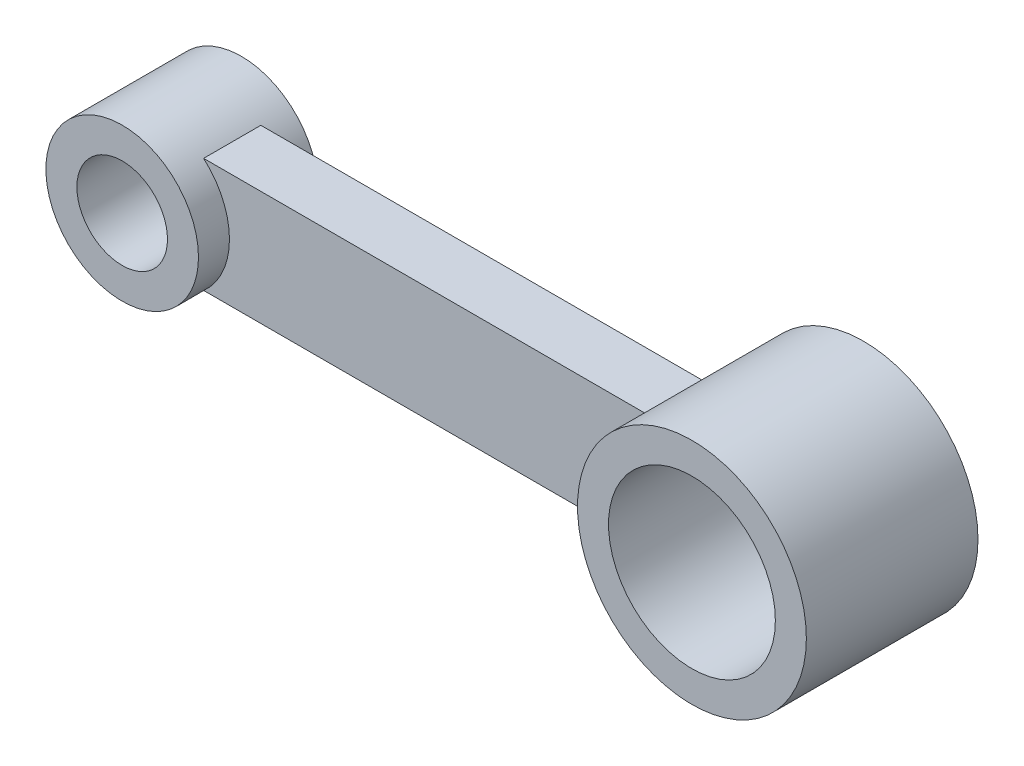
ISO-10303-21;
HEADER;
FILE_DESCRIPTION(('STEP AP214'),'2;1');
FILE_NAME('part.step','',(''),(''),'','','');
FILE_SCHEMA(('AUTOMOTIVE_DESIGN { 1 0 10303 214 1 1 1 1 }'));
ENDSEC;
DATA;
#1=APPLICATION_CONTEXT('core data for automotive mechanical design processes');
#2=APPLICATION_PROTOCOL_DEFINITION('international standard','automotive_design',2000,#1);
#3=PRODUCT_CONTEXT('',#1,'mechanical');
#4=PRODUCT('Part','Part','',(#3));
#5=PRODUCT_RELATED_PRODUCT_CATEGORY('part','',(#4));
#6=PRODUCT_DEFINITION_FORMATION('','',#4);
#7=PRODUCT_DEFINITION_CONTEXT('part definition',#1,'design');
#8=PRODUCT_DEFINITION('design','',#6,#7);
#9=PRODUCT_DEFINITION_SHAPE('','',#8);
#10=(LENGTH_UNIT() NAMED_UNIT(*) SI_UNIT(.MILLI.,.METRE.));
#11=(NAMED_UNIT(*) PLANE_ANGLE_UNIT() SI_UNIT($,.RADIAN.));
#12=(NAMED_UNIT(*) SI_UNIT($,.STERADIAN.) SOLID_ANGLE_UNIT());
#13=UNCERTAINTY_MEASURE_WITH_UNIT(LENGTH_MEASURE(1.E-05),#10,'distance_accuracy_value','');
#14=(GEOMETRIC_REPRESENTATION_CONTEXT(3) GLOBAL_UNCERTAINTY_ASSIGNED_CONTEXT((#13)) GLOBAL_UNIT_ASSIGNED_CONTEXT((#10,
#11,#12)) REPRESENTATION_CONTEXT('',''));
#15=CARTESIAN_POINT('',(0.,0.,0.));
#16=DIRECTION('',(0.,0.,1.));
#17=DIRECTION('',(1.,0.,0.));
#18=AXIS2_PLACEMENT_3D('',#15,#16,#17);
#19=CARTESIAN_POINT('',(0.,0.,36.));
#20=DIRECTION('',(0.,0.,-1.));
#21=DIRECTION('',(-1.,0.,0.));
#22=AXIS2_PLACEMENT_3D('',#19,#20,#21);
#23=CYLINDRICAL_SURFACE('',#22,9.5);
#24=CARTESIAN_POINT('',(0.,0.,30.5));
#25=DIRECTION('',(0.,0.,1.));
#26=DIRECTION('',(1.,0.,0.));
#27=AXIS2_PLACEMENT_3D('',#24,#25,#26);
#28=CIRCLE('',#27,9.5);
#29=CARTESIAN_POINT('',(9.5,0.,30.5));
#30=VERTEX_POINT('',#29);
#31=EDGE_CURVE('E121',#30,#30,#28,.T.);
#32=ORIENTED_EDGE('',*,*,#31,.T.);
#33=EDGE_LOOP('',(#32));
#34=FACE_BOUND('',#33,.T.);
#35=CARTESIAN_POINT('',(0.,0.,5.5));
#36=DIRECTION('',(0.,0.,-1.));
#37=DIRECTION('',(-1.,0.,0.));
#38=AXIS2_PLACEMENT_3D('',#35,#36,#37);
#39=CIRCLE('',#38,9.5);
#40=CARTESIAN_POINT('',(-9.5,0.,5.5));
#41=VERTEX_POINT('',#40);
#42=EDGE_CURVE('E125',#41,#41,#39,.T.);
#43=ORIENTED_EDGE('',*,*,#42,.T.);
#44=EDGE_LOOP('',(#43));
#45=FACE_BOUND('',#44,.T.);
#46=ADVANCED_FACE('F53',(#34,#45),#23,.F.);
#47=CARTESIAN_POINT('',(0.,0.,36.));
#48=DIRECTION('',(0.,0.,-1.));
#49=DIRECTION('',(-1.,0.,0.));
#50=AXIS2_PLACEMENT_3D('',#47,#48,#49);
#51=CYLINDRICAL_SURFACE('',#50,16.);
#52=CARTESIAN_POINT('',(10.5262325278914,-12.0498310680591,5.5));
#53=DIRECTION('',(-0.761607730700984,-0.64803832026856,0.));
#54=VECTOR('',#53,1.);
#55=LINE('',#52,#54);
#56=CARTESIAN_POINT('',(10.5262325278913,-12.0498310680592,5.5));
#57=VERTEX_POINT('',#56);
#58=CARTESIAN_POINT('',(10.2092395343754,-12.3195547050105,5.5));
#59=VERTEX_POINT('',#58);
#60=EDGE_CURVE('E113',#57,#59,#55,.T.);
#61=ORIENTED_EDGE('',*,*,#60,.F.);
#62=CARTESIAN_POINT('',(0.,0.,5.5));
#63=DIRECTION('',(0.,0.,-1.));
#64=DIRECTION('',(-1.,0.,0.));
#65=AXIS2_PLACEMENT_3D('',#62,#63,#64);
#66=CIRCLE('',#65,16.);
#67=EDGE_CURVE('E117',#59,#57,#66,.T.);
#68=ORIENTED_EDGE('',*,*,#67,.F.);
#69=EDGE_LOOP('',(#61,#68));
#70=FACE_BOUND('',#69,.T.);
#71=CARTESIAN_POINT('',(0.,0.,30.5));
#72=DIRECTION('',(0.,0.,1.));
#73=DIRECTION('',(1.,0.,0.));
#74=AXIS2_PLACEMENT_3D('',#71,#72,#73);
#75=CIRCLE('',#74,16.);
#76=CARTESIAN_POINT('',(16.,0.,30.5));
#77=VERTEX_POINT('',#76);
#78=EDGE_CURVE('E149',#77,#77,#75,.T.);
#79=ORIENTED_EDGE('',*,*,#78,.F.);
#80=EDGE_LOOP('',(#79));
#81=FACE_BOUND('',#80,.T.);
#82=CARTESIAN_POINT('',(0.,0.,12.));
#83=DIRECTION('',(0.,0.,-1.));
#84=DIRECTION('',(-1.,0.,0.));
#85=AXIS2_PLACEMENT_3D('',#82,#83,#84);
#86=CIRCLE('',#85,16.);
#87=CARTESIAN_POINT('',(10.5830052442584,12.,12.));
#88=VERTEX_POINT('',#87);
#89=CARTESIAN_POINT('',(10.5830052442583,-12.,12.));
#90=VERTEX_POINT('',#89);
#91=EDGE_CURVE('E76',#88,#90,#86,.T.);
#92=ORIENTED_EDGE('',*,*,#91,.T.);
#93=DIRECTION('',(0.,0.,-1.));
#94=VECTOR('',#93,1.);
#95=CARTESIAN_POINT('',(10.5830052442583,-12.,36.));
#96=LINE('',#95,#94);
#97=CARTESIAN_POINT('',(10.5830052442583,-12.,24.));
#98=VERTEX_POINT('',#97);
#99=EDGE_CURVE('E12',#98,#90,#96,.T.);
#100=ORIENTED_EDGE('',*,*,#99,.F.);
#101=CARTESIAN_POINT('',(0.,0.,24.));
#102=DIRECTION('',(0.,0.,-1.));
#103=DIRECTION('',(-1.,0.,0.));
#104=AXIS2_PLACEMENT_3D('',#101,#102,#103);
#105=CIRCLE('',#104,16.);
#106=CARTESIAN_POINT('',(10.5830052442584,12.,24.));
#107=VERTEX_POINT('',#106);
#108=EDGE_CURVE('E171',#107,#98,#105,.T.);
#109=ORIENTED_EDGE('',*,*,#108,.F.);
#110=DIRECTION('',(0.,0.,-1.));
#111=VECTOR('',#110,1.);
#112=CARTESIAN_POINT('',(10.5830052442584,12.,36.));
#113=LINE('',#112,#111);
#114=EDGE_CURVE('E179',#107,#88,#113,.T.);
#115=ORIENTED_EDGE('',*,*,#114,.T.);
#116=EDGE_LOOP('',(#92,#100,#109,#115));
#117=FACE_BOUND('',#116,.T.);
#118=ADVANCED_FACE('F115',(#70,#81,#117),#51,.T.);
#119=CARTESIAN_POINT('',(0.,-12.,36.));
#120=DIRECTION('',(0.,-1.,0.));
#121=DIRECTION('',(1.,0.,0.));
#122=AXIS2_PLACEMENT_3D('',#119,#120,#121);
#123=PLANE('',#122);
#124=DIRECTION('',(1.,0.,0.));
#125=VECTOR('',#124,1.);
#126=CARTESIAN_POINT('',(0.,-12.,24.));
#127=LINE('',#126,#125);
#128=CARTESIAN_POINT('',(104.215390309173,-12.,24.));
#129=VERTEX_POINT('',#128);
#130=EDGE_CURVE('E299',#98,#129,#127,.T.);
#131=ORIENTED_EDGE('',*,*,#130,.F.);
#132=ORIENTED_EDGE('',*,*,#99,.T.);
#133=DIRECTION('',(-1.,0.,0.));
#134=VECTOR('',#133,1.);
#135=CARTESIAN_POINT('',(104.215390309173,-12.,12.));
#136=LINE('',#135,#134);
#137=CARTESIAN_POINT('',(104.215390309173,-12.,12.));
#138=VERTEX_POINT('',#137);
#139=EDGE_CURVE('E203',#138,#90,#136,.T.);
#140=ORIENTED_EDGE('',*,*,#139,.F.);
#141=DIRECTION('',(0.,0.,-1.));
#142=VECTOR('',#141,1.);
#143=CARTESIAN_POINT('',(104.215390309173,-12.,36.));
#144=LINE('',#143,#142);
#145=EDGE_CURVE('E65',#129,#138,#144,.T.);
#146=ORIENTED_EDGE('',*,*,#145,.F.);
#147=EDGE_LOOP('',(#131,#132,#140,#146));
#148=FACE_BOUND('',#147,.T.);
#149=ADVANCED_FACE('F247',(#148),#123,.T.);
#150=CARTESIAN_POINT('',(0.,12.,36.));
#151=DIRECTION('',(0.,-1.,0.));
#152=DIRECTION('',(1.,0.,0.));
#153=AXIS2_PLACEMENT_3D('',#150,#151,#152);
#154=PLANE('',#153);
#155=ORIENTED_EDGE('',*,*,#114,.F.);
#156=DIRECTION('',(-1.,0.,0.));
#157=VECTOR('',#156,1.);
#158=CARTESIAN_POINT('',(10.5830052442584,12.,24.));
#159=LINE('',#158,#157);
#160=CARTESIAN_POINT('',(104.215390309173,12.,24.));
#161=VERTEX_POINT('',#160);
#162=EDGE_CURVE('E158',#161,#107,#159,.T.);
#163=ORIENTED_EDGE('',*,*,#162,.F.);
#164=DIRECTION('',(0.,0.,-1.));
#165=VECTOR('',#164,1.);
#166=CARTESIAN_POINT('',(104.215390309173,12.,36.));
#167=LINE('',#166,#165);
#168=CARTESIAN_POINT('',(104.215390309173,12.,12.));
#169=VERTEX_POINT('',#168);
#170=EDGE_CURVE('E184',#161,#169,#167,.T.);
#171=ORIENTED_EDGE('',*,*,#170,.T.);
#172=DIRECTION('',(1.,0.,0.));
#173=VECTOR('',#172,1.);
#174=CARTESIAN_POINT('',(104.215390309173,12.,12.));
#175=LINE('',#174,#173);
#176=EDGE_CURVE('E198',#88,#169,#175,.T.);
#177=ORIENTED_EDGE('',*,*,#176,.F.);
#178=EDGE_LOOP('',(#155,#163,#171,#177));
#179=FACE_BOUND('',#178,.T.);
#180=ADVANCED_FACE('F276',(#179),#154,.F.);
#181=CARTESIAN_POINT('',(0.,0.,0.));
#182=DIRECTION('',(0.,0.,1.));
#183=DIRECTION('',(1.,0.,0.));
#184=AXIS2_PLACEMENT_3D('',#181,#182,#183);
#185=PLANE('',#184);
#186=CARTESIAN_POINT('',(125.,0.,0.));
#187=DIRECTION('',(0.,0.,1.));
#188=DIRECTION('',(1.,0.,0.));
#189=AXIS2_PLACEMENT_3D('',#186,#187,#188);
#190=CIRCLE('',#189,17.5);
#191=CARTESIAN_POINT('',(142.5,0.,0.));
#192=VERTEX_POINT('',#191);
#193=EDGE_CURVE('E186',#192,#192,#190,.T.);
#194=ORIENTED_EDGE('',*,*,#193,.T.);
#195=EDGE_LOOP('',(#194));
#196=FACE_BOUND('',#195,.T.);
#197=CARTESIAN_POINT('',(125.,0.,0.));
#198=DIRECTION('',(0.,0.,1.));
#199=DIRECTION('',(1.,0.,0.));
#200=AXIS2_PLACEMENT_3D('',#197,#198,#199);
#201=CIRCLE('',#200,24.);
#202=CARTESIAN_POINT('',(149.,0.,0.));
#203=VERTEX_POINT('',#202);
#204=EDGE_CURVE('E202',#203,#203,#201,.T.);
#205=ORIENTED_EDGE('',*,*,#204,.F.);
#206=EDGE_LOOP('',(#205));
#207=FACE_BOUND('',#206,.T.);
#208=ADVANCED_FACE('F223',(#196,#207),#185,.F.);
#209=CARTESIAN_POINT('',(125.,0.,36.));
#210=DIRECTION('',(0.,0.,-1.));
#211=DIRECTION('',(-1.,0.,0.));
#212=AXIS2_PLACEMENT_3D('',#209,#210,#211);
#213=CYLINDRICAL_SURFACE('',#212,24.);
#214=ORIENTED_EDGE('',*,*,#204,.T.);
#215=EDGE_LOOP('',(#214));
#216=FACE_BOUND('',#215,.T.);
#217=ORIENTED_EDGE('',*,*,#170,.F.);
#218=CARTESIAN_POINT('',(125.,0.,24.));
#219=DIRECTION('',(0.,0.,-1.));
#220=DIRECTION('',(1.,0.,0.));
#221=AXIS2_PLACEMENT_3D('',#218,#219,#220);
#222=CIRCLE('',#221,24.);
#223=EDGE_CURVE('E154',#129,#161,#222,.T.);
#224=ORIENTED_EDGE('',*,*,#223,.F.);
#225=ORIENTED_EDGE('',*,*,#145,.T.);
#226=CARTESIAN_POINT('',(125.,0.,12.));
#227=DIRECTION('',(0.,0.,-1.));
#228=DIRECTION('',(-1.,0.,0.));
#229=AXIS2_PLACEMENT_3D('',#226,#227,#228);
#230=CIRCLE('',#229,24.);
#231=EDGE_CURVE('E84',#138,#169,#230,.T.);
#232=ORIENTED_EDGE('',*,*,#231,.T.);
#233=EDGE_LOOP('',(#217,#224,#225,#232));
#234=FACE_BOUND('',#233,.T.);
#235=CARTESIAN_POINT('',(125.,0.,36.));
#236=DIRECTION('',(0.,0.,1.));
#237=DIRECTION('',(1.,0.,0.));
#238=AXIS2_PLACEMENT_3D('',#235,#236,#237);
#239=CIRCLE('',#238,24.);
#240=CARTESIAN_POINT('',(149.,0.,36.));
#241=VERTEX_POINT('',#240);
#242=EDGE_CURVE('E205',#241,#241,#239,.T.);
#243=ORIENTED_EDGE('',*,*,#242,.F.);
#244=EDGE_LOOP('',(#243));
#245=FACE_BOUND('',#244,.T.);
#246=ADVANCED_FACE('F229',(#216,#234,#245),#213,.T.);
#247=CARTESIAN_POINT('',(125.,0.,36.));
#248=DIRECTION('',(0.,0.,-1.));
#249=DIRECTION('',(-1.,0.,0.));
#250=AXIS2_PLACEMENT_3D('',#247,#248,#249);
#251=CYLINDRICAL_SURFACE('',#250,17.5);
#252=CARTESIAN_POINT('',(125.,0.,36.));
#253=DIRECTION('',(0.,0.,1.));
#254=DIRECTION('',(1.,0.,0.));
#255=AXIS2_PLACEMENT_3D('',#252,#253,#254);
#256=CIRCLE('',#255,17.5);
#257=CARTESIAN_POINT('',(142.5,0.,36.));
#258=VERTEX_POINT('',#257);
#259=EDGE_CURVE('E185',#258,#258,#256,.T.);
#260=ORIENTED_EDGE('',*,*,#259,.T.);
#261=EDGE_LOOP('',(#260));
#262=FACE_BOUND('',#261,.T.);
#263=ORIENTED_EDGE('',*,*,#193,.F.);
#264=EDGE_LOOP('',(#263));
#265=FACE_BOUND('',#264,.T.);
#266=ADVANCED_FACE('F226',(#262,#265),#251,.F.);
#267=CARTESIAN_POINT('',(0.,0.,36.));
#268=DIRECTION('',(0.,0.,1.));
#269=DIRECTION('',(1.,0.,0.));
#270=AXIS2_PLACEMENT_3D('',#267,#268,#269);
#271=PLANE('',#270);
#272=ORIENTED_EDGE('',*,*,#242,.T.);
#273=EDGE_LOOP('',(#272));
#274=FACE_BOUND('',#273,.T.);
#275=ORIENTED_EDGE('',*,*,#259,.F.);
#276=EDGE_LOOP('',(#275));
#277=FACE_BOUND('',#276,.T.);
#278=ADVANCED_FACE('F228',(#274,#277),#271,.T.);
#279=CARTESIAN_POINT('',(126.080418520846,0.,12.));
#280=DIRECTION('',(0.,0.,-1.));
#281=DIRECTION('',(-1.,0.,0.));
#282=AXIS2_PLACEMENT_3D('',#279,#280,#281);
#283=PLANE('',#282);
#284=ORIENTED_EDGE('',*,*,#91,.F.);
#285=ORIENTED_EDGE('',*,*,#176,.T.);
#286=ORIENTED_EDGE('',*,*,#231,.F.);
#287=ORIENTED_EDGE('',*,*,#139,.T.);
#288=EDGE_LOOP('',(#284,#285,#286,#287));
#289=FACE_BOUND('',#288,.T.);
#290=ADVANCED_FACE('F236',(#289),#283,.T.);
#291=CARTESIAN_POINT('',(-1.61697580557152,0.0152881632950953,24.));
#292=DIRECTION('',(0.,0.,-1.));
#293=DIRECTION('',(-1.,0.,0.));
#294=AXIS2_PLACEMENT_3D('',#291,#292,#293);
#295=PLANE('',#294);
#296=ORIENTED_EDGE('',*,*,#162,.T.);
#297=ORIENTED_EDGE('',*,*,#108,.T.);
#298=ORIENTED_EDGE('',*,*,#130,.T.);
#299=ORIENTED_EDGE('',*,*,#223,.T.);
#300=EDGE_LOOP('',(#296,#297,#298,#299));
#301=FACE_BOUND('',#300,.T.);
#302=ADVANCED_FACE('F258',(#301),#295,.F.);
#303=CARTESIAN_POINT('',(0.,0.,30.5));
#304=DIRECTION('',(0.,0.,1.));
#305=DIRECTION('',(1.,0.,0.));
#306=AXIS2_PLACEMENT_3D('',#303,#304,#305);
#307=PLANE('',#306);
#308=ORIENTED_EDGE('',*,*,#31,.F.);
#309=EDGE_LOOP('',(#308));
#310=FACE_BOUND('',#309,.T.);
#311=ORIENTED_EDGE('',*,*,#78,.T.);
#312=EDGE_LOOP('',(#311));
#313=FACE_BOUND('',#312,.T.);
#314=ADVANCED_FACE('F254',(#310,#313),#307,.T.);
#315=CARTESIAN_POINT('',(0.,0.,5.5));
#316=DIRECTION('',(0.,0.,-1.));
#317=DIRECTION('',(-1.,0.,0.));
#318=AXIS2_PLACEMENT_3D('',#315,#316,#317);
#319=PLANE('',#318);
#320=ORIENTED_EDGE('',*,*,#42,.F.);
#321=EDGE_LOOP('',(#320));
#322=FACE_BOUND('',#321,.T.);
#323=ORIENTED_EDGE('',*,*,#60,.T.);
#324=ORIENTED_EDGE('',*,*,#67,.T.);
#325=EDGE_LOOP('',(#323,#324));
#326=FACE_BOUND('',#325,.T.);
#327=ADVANCED_FACE('F123',(#322,#326),#319,.T.);
#328=CLOSED_SHELL('',(#46,#118,#149,#180,#208,#246,#266,#278,#290,#302,#314,#327));
#329=MANIFOLD_SOLID_BREP('B2',#328);
#330=ADVANCED_BREP_SHAPE_REPRESENTATION('',(#18,#329),#14);
#331=SHAPE_DEFINITION_REPRESENTATION(#9,#330);
ENDSEC;
END-ISO-10303-21;
